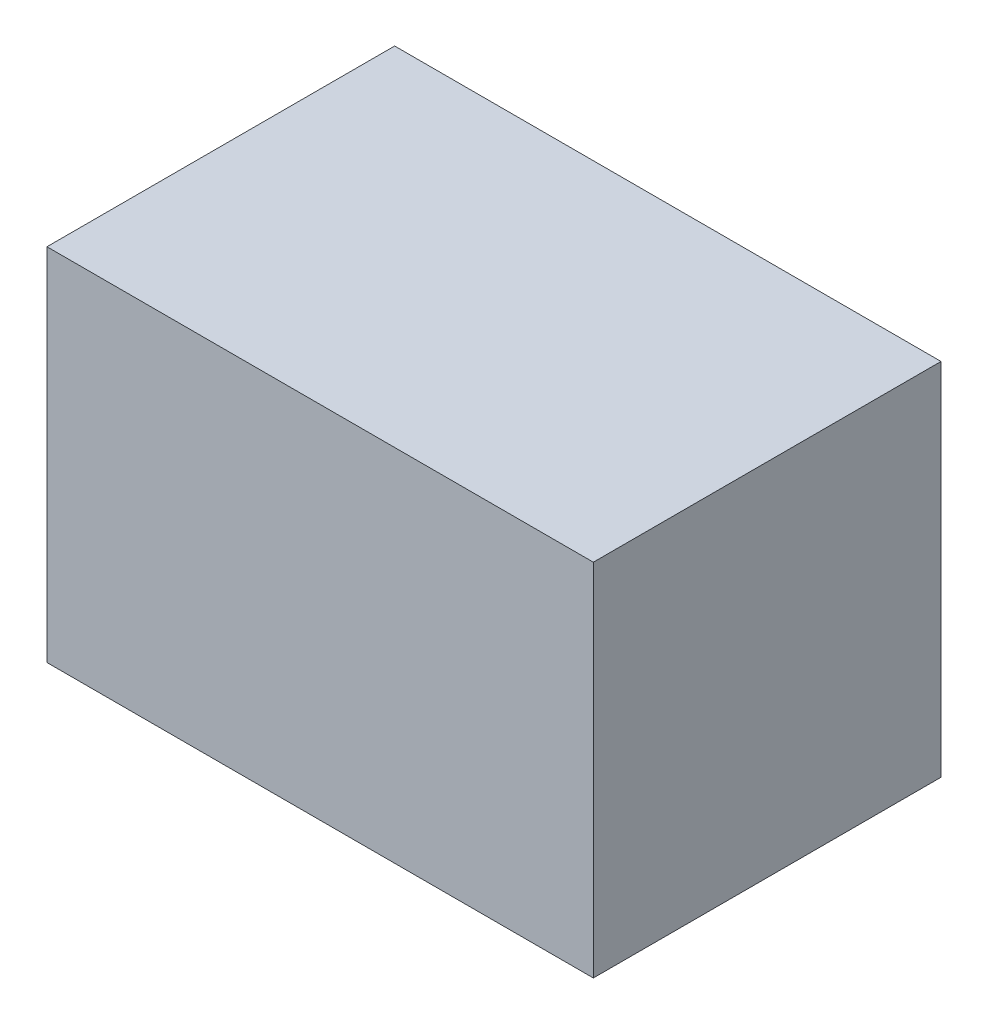
ISO-10303-21;
HEADER;
FILE_DESCRIPTION(('STEP AP214'),'2;1');
FILE_NAME('part.step','',(''),(''),'','','');
FILE_SCHEMA(('AUTOMOTIVE_DESIGN { 1 0 10303 214 1 1 1 1 }'));
ENDSEC;
DATA;
#1=APPLICATION_CONTEXT('core data for automotive mechanical design processes');
#2=APPLICATION_PROTOCOL_DEFINITION('international standard','automotive_design',2000,#1);
#3=PRODUCT_CONTEXT('',#1,'mechanical');
#4=PRODUCT('Part','Part','',(#3));
#5=PRODUCT_RELATED_PRODUCT_CATEGORY('part','',(#4));
#6=PRODUCT_DEFINITION_FORMATION('','',#4);
#7=PRODUCT_DEFINITION_CONTEXT('part definition',#1,'design');
#8=PRODUCT_DEFINITION('design','',#6,#7);
#9=PRODUCT_DEFINITION_SHAPE('','',#8);
#10=(LENGTH_UNIT() NAMED_UNIT(*) SI_UNIT(.MILLI.,.METRE.));
#11=(NAMED_UNIT(*) PLANE_ANGLE_UNIT() SI_UNIT($,.RADIAN.));
#12=(NAMED_UNIT(*) SI_UNIT($,.STERADIAN.) SOLID_ANGLE_UNIT());
#13=UNCERTAINTY_MEASURE_WITH_UNIT(LENGTH_MEASURE(1.E-05),#10,'distance_accuracy_value','');
#14=(GEOMETRIC_REPRESENTATION_CONTEXT(3) GLOBAL_UNCERTAINTY_ASSIGNED_CONTEXT((#13)) GLOBAL_UNIT_ASSIGNED_CONTEXT((#10,
#11,#12)) REPRESENTATION_CONTEXT('',''));
#15=CARTESIAN_POINT('',(0.,0.,0.));
#16=DIRECTION('',(0.,0.,1.));
#17=DIRECTION('',(1.,0.,0.));
#18=AXIS2_PLACEMENT_3D('',#15,#16,#17);
#19=CARTESIAN_POINT('',(-1.10000034,-0.72499982,0.));
#20=DIRECTION('',(0.,1.,0.));
#21=DIRECTION('',(1.,0.,0.));
#22=AXIS2_PLACEMENT_3D('',#19,#20,#21);
#23=PLANE('',#22);
#24=DIRECTION('',(1.,0.,0.));
#25=VECTOR('',#24,1.);
#26=CARTESIAN_POINT('',(-1.10000034,-0.72499982,0.));
#27=LINE('',#26,#25);
#28=CARTESIAN_POINT('',(-1.10000034,-0.72499982,0.));
#29=VERTEX_POINT('',#28);
#30=CARTESIAN_POINT('',(1.10000034,-0.72499982,0.));
#31=VERTEX_POINT('',#30);
#32=EDGE_CURVE('E11',#29,#31,#27,.T.);
#33=ORIENTED_EDGE('',*,*,#32,.T.);
#34=DIRECTION('',(0.,0.,1.));
#35=VECTOR('',#34,1.);
#36=CARTESIAN_POINT('',(1.10000034,-0.72499982,0.));
#37=LINE('',#36,#35);
#38=CARTESIAN_POINT('',(1.10000034,-0.72499982,1.39999974));
#39=VERTEX_POINT('',#38);
#40=EDGE_CURVE('E24',#31,#39,#37,.T.);
#41=ORIENTED_EDGE('',*,*,#40,.T.);
#42=DIRECTION('',(1.,0.,0.));
#43=VECTOR('',#42,1.);
#44=CARTESIAN_POINT('',(-1.10000034,-0.72499982,1.39999974));
#45=LINE('',#44,#43);
#46=CARTESIAN_POINT('',(-1.10000034,-0.72499982,1.39999974));
#47=VERTEX_POINT('',#46);
#48=EDGE_CURVE('E87',#47,#39,#45,.T.);
#49=ORIENTED_EDGE('',*,*,#48,.F.);
#50=DIRECTION('',(0.,0.,1.));
#51=VECTOR('',#50,1.);
#52=CARTESIAN_POINT('',(-1.10000034,-0.72499982,0.));
#53=LINE('',#52,#51);
#54=EDGE_CURVE('E36',#29,#47,#53,.T.);
#55=ORIENTED_EDGE('',*,*,#54,.F.);
#56=EDGE_LOOP('',(#33,#41,#49,#55));
#57=FACE_BOUND('',#56,.T.);
#58=ADVANCED_FACE('F17',(#57),#23,.F.);
#59=CARTESIAN_POINT('',(1.10000034,-0.72499982,0.));
#60=DIRECTION('',(-1.,0.,0.));
#61=DIRECTION('',(0.,1.,0.));
#62=AXIS2_PLACEMENT_3D('',#59,#60,#61);
#63=PLANE('',#62);
#64=DIRECTION('',(0.,1.,0.));
#65=VECTOR('',#64,1.);
#66=CARTESIAN_POINT('',(1.10000034,-0.72499982,0.));
#67=LINE('',#66,#65);
#68=CARTESIAN_POINT('',(1.10000034,0.72499982,0.));
#69=VERTEX_POINT('',#68);
#70=EDGE_CURVE('E84',#31,#69,#67,.T.);
#71=ORIENTED_EDGE('',*,*,#70,.T.);
#72=DIRECTION('',(0.,0.,1.));
#73=VECTOR('',#72,1.);
#74=CARTESIAN_POINT('',(1.10000034,0.72499982,0.));
#75=LINE('',#74,#73);
#76=CARTESIAN_POINT('',(1.10000034,0.72499982,1.39999974));
#77=VERTEX_POINT('',#76);
#78=EDGE_CURVE('E82',#69,#77,#75,.T.);
#79=ORIENTED_EDGE('',*,*,#78,.T.);
#80=DIRECTION('',(0.,1.,0.));
#81=VECTOR('',#80,1.);
#82=CARTESIAN_POINT('',(1.10000034,-0.72499982,1.39999974));
#83=LINE('',#82,#81);
#84=EDGE_CURVE('E62',#39,#77,#83,.T.);
#85=ORIENTED_EDGE('',*,*,#84,.F.);
#86=ORIENTED_EDGE('',*,*,#40,.F.);
#87=EDGE_LOOP('',(#71,#79,#85,#86));
#88=FACE_BOUND('',#87,.T.);
#89=ADVANCED_FACE('F89',(#88),#63,.F.);
#90=CARTESIAN_POINT('',(1.10000034,0.72499982,0.));
#91=DIRECTION('',(0.,-1.,0.));
#92=DIRECTION('',(-1.,0.,0.));
#93=AXIS2_PLACEMENT_3D('',#90,#91,#92);
#94=PLANE('',#93);
#95=DIRECTION('',(-1.,0.,0.));
#96=VECTOR('',#95,1.);
#97=CARTESIAN_POINT('',(1.10000034,0.72499982,0.));
#98=LINE('',#97,#96);
#99=CARTESIAN_POINT('',(-1.10000034,0.72499982,0.));
#100=VERTEX_POINT('',#99);
#101=EDGE_CURVE('E71',#69,#100,#98,.T.);
#102=ORIENTED_EDGE('',*,*,#101,.T.);
#103=DIRECTION('',(0.,0.,1.));
#104=VECTOR('',#103,1.);
#105=CARTESIAN_POINT('',(-1.10000034,0.72499982,0.));
#106=LINE('',#105,#104);
#107=CARTESIAN_POINT('',(-1.10000034,0.72499982,1.39999974));
#108=VERTEX_POINT('',#107);
#109=EDGE_CURVE('E65',#100,#108,#106,.T.);
#110=ORIENTED_EDGE('',*,*,#109,.T.);
#111=DIRECTION('',(-1.,0.,0.));
#112=VECTOR('',#111,1.);
#113=CARTESIAN_POINT('',(1.10000034,0.72499982,1.39999974));
#114=LINE('',#113,#112);
#115=EDGE_CURVE('E57',#77,#108,#114,.T.);
#116=ORIENTED_EDGE('',*,*,#115,.F.);
#117=ORIENTED_EDGE('',*,*,#78,.F.);
#118=EDGE_LOOP('',(#102,#110,#116,#117));
#119=FACE_BOUND('',#118,.T.);
#120=ADVANCED_FACE('F69',(#119),#94,.F.);
#121=CARTESIAN_POINT('',(-1.10000034,0.72499982,0.));
#122=DIRECTION('',(1.,0.,0.));
#123=DIRECTION('',(0.,-1.,0.));
#124=AXIS2_PLACEMENT_3D('',#121,#122,#123);
#125=PLANE('',#124);
#126=DIRECTION('',(0.,-1.,0.));
#127=VECTOR('',#126,1.);
#128=CARTESIAN_POINT('',(-1.10000034,0.72499982,0.));
#129=LINE('',#128,#127);
#130=EDGE_CURVE('E66',#100,#29,#129,.T.);
#131=ORIENTED_EDGE('',*,*,#130,.T.);
#132=ORIENTED_EDGE('',*,*,#54,.T.);
#133=DIRECTION('',(0.,-1.,0.));
#134=VECTOR('',#133,1.);
#135=CARTESIAN_POINT('',(-1.10000034,0.72499982,1.39999974));
#136=LINE('',#135,#134);
#137=EDGE_CURVE('E61',#108,#47,#136,.T.);
#138=ORIENTED_EDGE('',*,*,#137,.F.);
#139=ORIENTED_EDGE('',*,*,#109,.F.);
#140=EDGE_LOOP('',(#131,#132,#138,#139));
#141=FACE_BOUND('',#140,.T.);
#142=ADVANCED_FACE('F76',(#141),#125,.F.);
#143=CARTESIAN_POINT('',(-1.10000034,-0.72499982,0.));
#144=DIRECTION('',(0.,0.,-1.));
#145=DIRECTION('',(-1.,0.,0.));
#146=AXIS2_PLACEMENT_3D('',#143,#144,#145);
#147=PLANE('',#146);
#148=ORIENTED_EDGE('',*,*,#130,.F.);
#149=ORIENTED_EDGE('',*,*,#101,.F.);
#150=ORIENTED_EDGE('',*,*,#70,.F.);
#151=ORIENTED_EDGE('',*,*,#32,.F.);
#152=EDGE_LOOP('',(#148,#149,#150,#151));
#153=FACE_BOUND('',#152,.T.);
#154=ADVANCED_FACE('F91',(#153),#147,.T.);
#155=CARTESIAN_POINT('',(-1.10000034,-0.72499982,1.39999974));
#156=DIRECTION('',(0.,0.,-1.));
#157=DIRECTION('',(-1.,0.,0.));
#158=AXIS2_PLACEMENT_3D('',#155,#156,#157);
#159=PLANE('',#158);
#160=ORIENTED_EDGE('',*,*,#48,.T.);
#161=ORIENTED_EDGE('',*,*,#84,.T.);
#162=ORIENTED_EDGE('',*,*,#115,.T.);
#163=ORIENTED_EDGE('',*,*,#137,.T.);
#164=EDGE_LOOP('',(#160,#161,#162,#163));
#165=FACE_BOUND('',#164,.T.);
#166=ADVANCED_FACE('F59',(#165),#159,.F.);
#167=CLOSED_SHELL('',(#58,#89,#120,#142,#154,#166));
#168=MANIFOLD_SOLID_BREP('B1',#167);
#169=ADVANCED_BREP_SHAPE_REPRESENTATION('',(#18,#168),#14);
#170=SHAPE_DEFINITION_REPRESENTATION(#9,#169);
ENDSEC;
END-ISO-10303-21;
